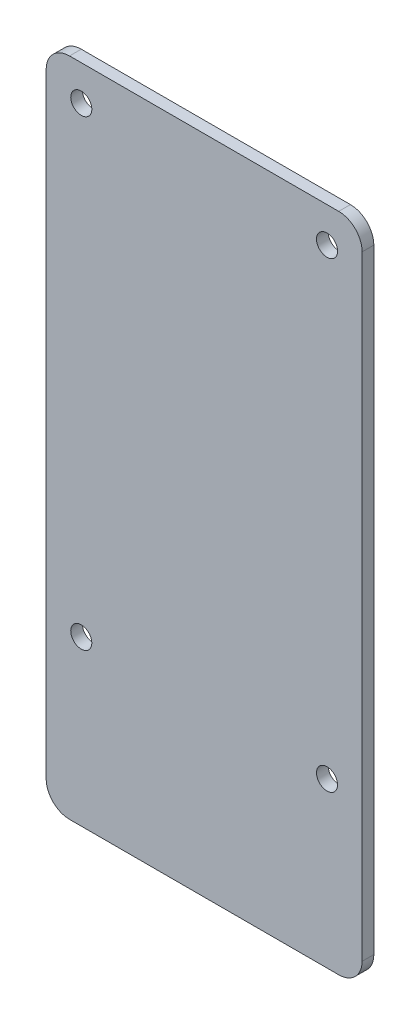
ISO-10303-21;
HEADER;
FILE_DESCRIPTION(('STEP AP214'),'2;1');
FILE_NAME('part.step','',(''),(''),'','','');
FILE_SCHEMA(('AUTOMOTIVE_DESIGN { 1 0 10303 214 1 1 1 1 }'));
ENDSEC;
DATA;
#1=APPLICATION_CONTEXT('core data for automotive mechanical design processes');
#2=APPLICATION_PROTOCOL_DEFINITION('international standard','automotive_design',2000,#1);
#3=PRODUCT_CONTEXT('',#1,'mechanical');
#4=PRODUCT('Part','Part','',(#3));
#5=PRODUCT_RELATED_PRODUCT_CATEGORY('part','',(#4));
#6=PRODUCT_DEFINITION_FORMATION('','',#4);
#7=PRODUCT_DEFINITION_CONTEXT('part definition',#1,'design');
#8=PRODUCT_DEFINITION('design','',#6,#7);
#9=PRODUCT_DEFINITION_SHAPE('','',#8);
#10=(LENGTH_UNIT() NAMED_UNIT(*) SI_UNIT(.MILLI.,.METRE.));
#11=(NAMED_UNIT(*) PLANE_ANGLE_UNIT() SI_UNIT($,.RADIAN.));
#12=(NAMED_UNIT(*) SI_UNIT($,.STERADIAN.) SOLID_ANGLE_UNIT());
#13=UNCERTAINTY_MEASURE_WITH_UNIT(LENGTH_MEASURE(1.E-05),#10,'distance_accuracy_value','');
#14=(GEOMETRIC_REPRESENTATION_CONTEXT(3) GLOBAL_UNCERTAINTY_ASSIGNED_CONTEXT((#13)) GLOBAL_UNIT_ASSIGNED_CONTEXT((#10,
#11,#12)) REPRESENTATION_CONTEXT('',''));
#15=CARTESIAN_POINT('',(0.,0.,0.));
#16=DIRECTION('',(0.,0.,1.));
#17=DIRECTION('',(1.,0.,0.));
#18=AXIS2_PLACEMENT_3D('',#15,#16,#17);
#19=CARTESIAN_POINT('',(-140.00000048,85.00000126,2.));
#20=DIRECTION('',(0.,0.,-1.));
#21=DIRECTION('',(-1.,0.,0.));
#22=AXIS2_PLACEMENT_3D('',#19,#20,#21);
#23=CYLINDRICAL_SURFACE('',#22,4.);
#24=CARTESIAN_POINT('',(-140.00000048,85.00000126,0.));
#25=DIRECTION('',(0.,0.,1.));
#26=DIRECTION('',(1.,0.,0.));
#27=AXIS2_PLACEMENT_3D('',#24,#25,#26);
#28=CIRCLE('',#27,4.);
#29=CARTESIAN_POINT('',(-140.00000048,89.00000126,0.));
#30=VERTEX_POINT('',#29);
#31=CARTESIAN_POINT('',(-144.00000048,85.00000126,0.));
#32=VERTEX_POINT('',#31);
#33=EDGE_CURVE('E130',#30,#32,#28,.T.);
#34=ORIENTED_EDGE('',*,*,#33,.T.);
#35=DIRECTION('',(0.,0.,-1.));
#36=VECTOR('',#35,1.);
#37=CARTESIAN_POINT('',(-144.00000048,85.00000126,2.));
#38=LINE('',#37,#36);
#39=CARTESIAN_POINT('',(-144.00000048,85.00000126,2.));
#40=VERTEX_POINT('',#39);
#41=EDGE_CURVE('E11',#40,#32,#38,.T.);
#42=ORIENTED_EDGE('',*,*,#41,.F.);
#43=CARTESIAN_POINT('',(-140.00000048,85.00000126,2.));
#44=DIRECTION('',(0.,0.,1.));
#45=DIRECTION('',(1.,0.,0.));
#46=AXIS2_PLACEMENT_3D('',#43,#44,#45);
#47=CIRCLE('',#46,4.);
#48=CARTESIAN_POINT('',(-140.00000048,89.00000126,2.));
#49=VERTEX_POINT('',#48);
#50=EDGE_CURVE('E144',#49,#40,#47,.T.);
#51=ORIENTED_EDGE('',*,*,#50,.F.);
#52=DIRECTION('',(0.,0.,-1.));
#53=VECTOR('',#52,1.);
#54=CARTESIAN_POINT('',(-140.00000048,89.00000126,2.));
#55=LINE('',#54,#53);
#56=EDGE_CURVE('E126',#49,#30,#55,.T.);
#57=ORIENTED_EDGE('',*,*,#56,.T.);
#58=EDGE_LOOP('',(#34,#42,#51,#57));
#59=FACE_BOUND('',#58,.T.);
#60=ADVANCED_FACE('F32',(#59),#23,.T.);
#61=CARTESIAN_POINT('',(-144.00000048,-19.99999918,2.));
#62=DIRECTION('',(1.,0.,0.));
#63=DIRECTION('',(0.,0.,-1.));
#64=AXIS2_PLACEMENT_3D('',#61,#62,#63);
#65=PLANE('',#64);
#66=DIRECTION('',(0.,-1.,0.));
#67=VECTOR('',#66,1.);
#68=CARTESIAN_POINT('',(-144.00000048,-19.99999918,0.));
#69=LINE('',#68,#67);
#70=CARTESIAN_POINT('',(-144.00000048,-19.99999918,0.));
#71=VERTEX_POINT('',#70);
#72=EDGE_CURVE('E133',#32,#71,#69,.T.);
#73=ORIENTED_EDGE('',*,*,#72,.T.);
#74=DIRECTION('',(0.,0.,-1.));
#75=VECTOR('',#74,1.);
#76=CARTESIAN_POINT('',(-144.00000048,-19.99999918,2.));
#77=LINE('',#76,#75);
#78=CARTESIAN_POINT('',(-144.00000048,-19.99999918,2.));
#79=VERTEX_POINT('',#78);
#80=EDGE_CURVE('E41',#79,#71,#77,.T.);
#81=ORIENTED_EDGE('',*,*,#80,.F.);
#82=DIRECTION('',(0.,-1.,0.));
#83=VECTOR('',#82,1.);
#84=CARTESIAN_POINT('',(-144.00000048,-19.99999918,2.));
#85=LINE('',#84,#83);
#86=EDGE_CURVE('E93',#40,#79,#85,.T.);
#87=ORIENTED_EDGE('',*,*,#86,.F.);
#88=ORIENTED_EDGE('',*,*,#41,.T.);
#89=EDGE_LOOP('',(#73,#81,#87,#88));
#90=FACE_BOUND('',#89,.T.);
#91=ADVANCED_FACE('F185',(#90),#65,.F.);
#92=CARTESIAN_POINT('',(-140.00000048,-19.99999918,2.));
#93=DIRECTION('',(0.,0.,-1.));
#94=DIRECTION('',(-1.,0.,0.));
#95=AXIS2_PLACEMENT_3D('',#92,#93,#94);
#96=CYLINDRICAL_SURFACE('',#95,4.);
#97=CARTESIAN_POINT('',(-140.00000048,-19.99999918,0.));
#98=DIRECTION('',(0.,0.,1.));
#99=DIRECTION('',(1.,0.,0.));
#100=AXIS2_PLACEMENT_3D('',#97,#98,#99);
#101=CIRCLE('',#100,4.);
#102=CARTESIAN_POINT('',(-140.00000048,-23.99999918,0.));
#103=VERTEX_POINT('',#102);
#104=EDGE_CURVE('E135',#71,#103,#101,.T.);
#105=ORIENTED_EDGE('',*,*,#104,.T.);
#106=DIRECTION('',(0.,0.,-1.));
#107=VECTOR('',#106,1.);
#108=CARTESIAN_POINT('',(-140.00000048,-23.99999918,2.));
#109=LINE('',#108,#107);
#110=CARTESIAN_POINT('',(-140.00000048,-23.99999918,2.));
#111=VERTEX_POINT('',#110);
#112=EDGE_CURVE('E151',#111,#103,#109,.T.);
#113=ORIENTED_EDGE('',*,*,#112,.F.);
#114=CARTESIAN_POINT('',(-140.00000048,-19.99999918,2.));
#115=DIRECTION('',(0.,0.,1.));
#116=DIRECTION('',(1.,0.,0.));
#117=AXIS2_PLACEMENT_3D('',#114,#115,#116);
#118=CIRCLE('',#117,4.);
#119=EDGE_CURVE('E200',#79,#111,#118,.T.);
#120=ORIENTED_EDGE('',*,*,#119,.F.);
#121=ORIENTED_EDGE('',*,*,#80,.T.);
#122=EDGE_LOOP('',(#105,#113,#120,#121));
#123=FACE_BOUND('',#122,.T.);
#124=ADVANCED_FACE('F190',(#123),#96,.T.);
#125=CARTESIAN_POINT('',(-93.99999888,-23.99999918,2.));
#126=DIRECTION('',(0.,1.,0.));
#127=DIRECTION('',(0.,0.,1.));
#128=AXIS2_PLACEMENT_3D('',#125,#126,#127);
#129=PLANE('',#128);
#130=DIRECTION('',(1.,0.,0.));
#131=VECTOR('',#130,1.);
#132=CARTESIAN_POINT('',(-93.99999888,-23.99999918,0.));
#133=LINE('',#132,#131);
#134=CARTESIAN_POINT('',(-93.99999888,-23.99999918,0.));
#135=VERTEX_POINT('',#134);
#136=EDGE_CURVE('E137',#103,#135,#133,.T.);
#137=ORIENTED_EDGE('',*,*,#136,.T.);
#138=DIRECTION('',(0.,0.,-1.));
#139=VECTOR('',#138,1.);
#140=CARTESIAN_POINT('',(-93.99999888,-23.99999918,2.));
#141=LINE('',#140,#139);
#142=CARTESIAN_POINT('',(-93.99999888,-23.99999918,2.));
#143=VERTEX_POINT('',#142);
#144=EDGE_CURVE('E148',#143,#135,#141,.T.);
#145=ORIENTED_EDGE('',*,*,#144,.F.);
#146=DIRECTION('',(1.,0.,0.));
#147=VECTOR('',#146,1.);
#148=CARTESIAN_POINT('',(-93.99999888,-23.99999918,2.));
#149=LINE('',#148,#147);
#150=EDGE_CURVE('E202',#111,#143,#149,.T.);
#151=ORIENTED_EDGE('',*,*,#150,.F.);
#152=ORIENTED_EDGE('',*,*,#112,.T.);
#153=EDGE_LOOP('',(#137,#145,#151,#152));
#154=FACE_BOUND('',#153,.T.);
#155=ADVANCED_FACE('F252',(#154),#129,.F.);
#156=CARTESIAN_POINT('',(-93.99999888,-19.99999918,2.));
#157=DIRECTION('',(0.,0.,-1.));
#158=DIRECTION('',(-1.,0.,0.));
#159=AXIS2_PLACEMENT_3D('',#156,#157,#158);
#160=CYLINDRICAL_SURFACE('',#159,4.);
#161=CARTESIAN_POINT('',(-93.99999888,-19.99999918,0.));
#162=DIRECTION('',(0.,0.,1.));
#163=DIRECTION('',(1.,0.,0.));
#164=AXIS2_PLACEMENT_3D('',#161,#162,#163);
#165=CIRCLE('',#164,4.);
#166=CARTESIAN_POINT('',(-89.99999888,-19.99999918,0.));
#167=VERTEX_POINT('',#166);
#168=EDGE_CURVE('E139',#135,#167,#165,.T.);
#169=ORIENTED_EDGE('',*,*,#168,.T.);
#170=DIRECTION('',(0.,0.,-1.));
#171=VECTOR('',#170,1.);
#172=CARTESIAN_POINT('',(-89.99999888,-19.99999918,2.));
#173=LINE('',#172,#171);
#174=CARTESIAN_POINT('',(-89.99999888,-19.99999918,2.));
#175=VERTEX_POINT('',#174);
#176=EDGE_CURVE('E121',#175,#167,#173,.T.);
#177=ORIENTED_EDGE('',*,*,#176,.F.);
#178=CARTESIAN_POINT('',(-93.99999888,-19.99999918,2.));
#179=DIRECTION('',(0.,0.,1.));
#180=DIRECTION('',(1.,0.,0.));
#181=AXIS2_PLACEMENT_3D('',#178,#179,#180);
#182=CIRCLE('',#181,4.);
#183=EDGE_CURVE('E112',#143,#175,#182,.T.);
#184=ORIENTED_EDGE('',*,*,#183,.F.);
#185=ORIENTED_EDGE('',*,*,#144,.T.);
#186=EDGE_LOOP('',(#169,#177,#184,#185));
#187=FACE_BOUND('',#186,.T.);
#188=ADVANCED_FACE('F249',(#187),#160,.T.);
#189=CARTESIAN_POINT('',(-89.99999888,85.00000126,2.));
#190=DIRECTION('',(-1.,0.,0.));
#191=DIRECTION('',(0.,0.,1.));
#192=AXIS2_PLACEMENT_3D('',#189,#190,#191);
#193=PLANE('',#192);
#194=DIRECTION('',(0.,1.,0.));
#195=VECTOR('',#194,1.);
#196=CARTESIAN_POINT('',(-89.99999888,85.00000126,0.));
#197=LINE('',#196,#195);
#198=CARTESIAN_POINT('',(-89.99999888,85.00000126,0.));
#199=VERTEX_POINT('',#198);
#200=EDGE_CURVE('E120',#167,#199,#197,.T.);
#201=ORIENTED_EDGE('',*,*,#200,.T.);
#202=DIRECTION('',(0.,0.,-1.));
#203=VECTOR('',#202,1.);
#204=CARTESIAN_POINT('',(-89.99999888,85.00000126,2.));
#205=LINE('',#204,#203);
#206=CARTESIAN_POINT('',(-89.99999888,85.00000126,2.));
#207=VERTEX_POINT('',#206);
#208=EDGE_CURVE('E117',#207,#199,#205,.T.);
#209=ORIENTED_EDGE('',*,*,#208,.F.);
#210=DIRECTION('',(0.,1.,0.));
#211=VECTOR('',#210,1.);
#212=CARTESIAN_POINT('',(-89.99999888,85.00000126,2.));
#213=LINE('',#212,#211);
#214=EDGE_CURVE('E106',#175,#207,#213,.T.);
#215=ORIENTED_EDGE('',*,*,#214,.F.);
#216=ORIENTED_EDGE('',*,*,#176,.T.);
#217=EDGE_LOOP('',(#201,#209,#215,#216));
#218=FACE_BOUND('',#217,.T.);
#219=ADVANCED_FACE('F118',(#218),#193,.F.);
#220=CARTESIAN_POINT('',(-93.99999888,85.00000126,2.));
#221=DIRECTION('',(0.,0.,-1.));
#222=DIRECTION('',(-1.,0.,0.));
#223=AXIS2_PLACEMENT_3D('',#220,#221,#222);
#224=CYLINDRICAL_SURFACE('',#223,4.);
#225=CARTESIAN_POINT('',(-93.99999888,85.00000126,0.));
#226=DIRECTION('',(0.,0.,1.));
#227=DIRECTION('',(1.,0.,0.));
#228=AXIS2_PLACEMENT_3D('',#225,#226,#227);
#229=CIRCLE('',#228,4.);
#230=CARTESIAN_POINT('',(-93.99999888,89.00000126,0.));
#231=VERTEX_POINT('',#230);
#232=EDGE_CURVE('E79',#199,#231,#229,.T.);
#233=ORIENTED_EDGE('',*,*,#232,.T.);
#234=DIRECTION('',(0.,0.,-1.));
#235=VECTOR('',#234,1.);
#236=CARTESIAN_POINT('',(-93.99999888,89.00000126,2.));
#237=LINE('',#236,#235);
#238=CARTESIAN_POINT('',(-93.99999888,89.00000126,2.));
#239=VERTEX_POINT('',#238);
#240=EDGE_CURVE('E122',#239,#231,#237,.T.);
#241=ORIENTED_EDGE('',*,*,#240,.F.);
#242=CARTESIAN_POINT('',(-93.99999888,85.00000126,2.));
#243=DIRECTION('',(0.,0.,1.));
#244=DIRECTION('',(1.,0.,0.));
#245=AXIS2_PLACEMENT_3D('',#242,#243,#244);
#246=CIRCLE('',#245,4.);
#247=EDGE_CURVE('E110',#207,#239,#246,.T.);
#248=ORIENTED_EDGE('',*,*,#247,.F.);
#249=ORIENTED_EDGE('',*,*,#208,.T.);
#250=EDGE_LOOP('',(#233,#241,#248,#249));
#251=FACE_BOUND('',#250,.T.);
#252=ADVANCED_FACE('F124',(#251),#224,.T.);
#253=CARTESIAN_POINT('',(-140.00000048,89.00000126,2.));
#254=DIRECTION('',(0.,-1.,0.));
#255=DIRECTION('',(0.,0.,-1.));
#256=AXIS2_PLACEMENT_3D('',#253,#254,#255);
#257=PLANE('',#256);
#258=DIRECTION('',(-1.,0.,0.));
#259=VECTOR('',#258,1.);
#260=CARTESIAN_POINT('',(-140.00000048,89.00000126,0.));
#261=LINE('',#260,#259);
#262=EDGE_CURVE('E85',#231,#30,#261,.T.);
#263=ORIENTED_EDGE('',*,*,#262,.T.);
#264=ORIENTED_EDGE('',*,*,#56,.F.);
#265=DIRECTION('',(-1.,0.,0.));
#266=VECTOR('',#265,1.);
#267=CARTESIAN_POINT('',(-140.00000048,89.00000126,2.));
#268=LINE('',#267,#266);
#269=EDGE_CURVE('E50',#239,#49,#268,.T.);
#270=ORIENTED_EDGE('',*,*,#269,.F.);
#271=ORIENTED_EDGE('',*,*,#240,.T.);
#272=EDGE_LOOP('',(#263,#264,#270,#271));
#273=FACE_BOUND('',#272,.T.);
#274=ADVANCED_FACE('F240',(#273),#257,.F.);
#275=CARTESIAN_POINT('',(-140.00000048,85.00000126,2.));
#276=DIRECTION('',(0.,0.,1.));
#277=DIRECTION('',(1.,0.,0.));
#278=AXIS2_PLACEMENT_3D('',#275,#276,#277);
#279=PLANE('',#278);
#280=CARTESIAN_POINT('',(-137.9999985,82.9999996200002,2.));
#281=DIRECTION('',(0.,0.,-1.));
#282=DIRECTION('',(-1.,0.,0.));
#283=AXIS2_PLACEMENT_3D('',#280,#281,#282);
#284=CIRCLE('',#283,1.79999999998381);
#285=CARTESIAN_POINT('',(-139.799998499984,82.9999996200002,2.));
#286=VERTEX_POINT('',#285);
#287=EDGE_CURVE('E210',#286,#286,#284,.T.);
#288=ORIENTED_EDGE('',*,*,#287,.T.);
#289=EDGE_LOOP('',(#288));
#290=FACE_BOUND('',#289,.T.);
#291=CARTESIAN_POINT('',(-95.9999985,3.99999962,2.));
#292=DIRECTION('',(0.,0.,-1.));
#293=DIRECTION('',(-1.,0.,0.));
#294=AXIS2_PLACEMENT_3D('',#291,#292,#293);
#295=CIRCLE('',#294,1.80000000001064);
#296=CARTESIAN_POINT('',(-97.7999985000106,3.99999962,2.));
#297=VERTEX_POINT('',#296);
#298=EDGE_CURVE('E211',#297,#297,#295,.T.);
#299=ORIENTED_EDGE('',*,*,#298,.T.);
#300=EDGE_LOOP('',(#299));
#301=FACE_BOUND('',#300,.T.);
#302=CARTESIAN_POINT('',(-137.9999985,3.99999962000014,2.));
#303=DIRECTION('',(0.,0.,-1.));
#304=DIRECTION('',(-1.,0.,0.));
#305=AXIS2_PLACEMENT_3D('',#302,#303,#304);
#306=CIRCLE('',#305,1.79999999998381);
#307=CARTESIAN_POINT('',(-139.799998499984,3.99999962000014,2.));
#308=VERTEX_POINT('',#307);
#309=EDGE_CURVE('E214',#308,#308,#306,.T.);
#310=ORIENTED_EDGE('',*,*,#309,.T.);
#311=EDGE_LOOP('',(#310));
#312=FACE_BOUND('',#311,.T.);
#313=CARTESIAN_POINT('',(-95.9999984999997,82.99999962,2.));
#314=DIRECTION('',(0.,0.,-1.));
#315=DIRECTION('',(-1.,0.,0.));
#316=AXIS2_PLACEMENT_3D('',#313,#314,#315);
#317=CIRCLE('',#316,1.80000000001064);
#318=CARTESIAN_POINT('',(-97.7999985000104,82.99999962,2.));
#319=VERTEX_POINT('',#318);
#320=EDGE_CURVE('E160',#319,#319,#317,.T.);
#321=ORIENTED_EDGE('',*,*,#320,.T.);
#322=EDGE_LOOP('',(#321));
#323=FACE_BOUND('',#322,.T.);
#324=ORIENTED_EDGE('',*,*,#50,.T.);
#325=ORIENTED_EDGE('',*,*,#86,.T.);
#326=ORIENTED_EDGE('',*,*,#119,.T.);
#327=ORIENTED_EDGE('',*,*,#150,.T.);
#328=ORIENTED_EDGE('',*,*,#183,.T.);
#329=ORIENTED_EDGE('',*,*,#214,.T.);
#330=ORIENTED_EDGE('',*,*,#247,.T.);
#331=ORIENTED_EDGE('',*,*,#269,.T.);
#332=EDGE_LOOP('',(#324,#325,#326,#327,#328,#329,#330,#331));
#333=FACE_BOUND('',#332,.T.);
#334=ADVANCED_FACE('F108',(#290,#301,#312,#323,#333),#279,.T.);
#335=CARTESIAN_POINT('',(-140.00000048,85.00000126,0.));
#336=DIRECTION('',(0.,0.,1.));
#337=DIRECTION('',(1.,0.,0.));
#338=AXIS2_PLACEMENT_3D('',#335,#336,#337);
#339=PLANE('',#338);
#340=CARTESIAN_POINT('',(-137.9999985,82.9999996200002,0.));
#341=DIRECTION('',(0.,0.,1.));
#342=DIRECTION('',(1.,0.,0.));
#343=AXIS2_PLACEMENT_3D('',#340,#341,#342);
#344=CIRCLE('',#343,1.79999999998381);
#345=CARTESIAN_POINT('',(-136.199998500016,82.9999996200002,0.));
#346=VERTEX_POINT('',#345);
#347=EDGE_CURVE('E35',#346,#346,#344,.T.);
#348=ORIENTED_EDGE('',*,*,#347,.T.);
#349=EDGE_LOOP('',(#348));
#350=FACE_BOUND('',#349,.T.);
#351=CARTESIAN_POINT('',(-95.9999985,3.99999962,0.));
#352=DIRECTION('',(0.,0.,1.));
#353=DIRECTION('',(1.,0.,0.));
#354=AXIS2_PLACEMENT_3D('',#351,#352,#353);
#355=CIRCLE('',#354,1.80000000001064);
#356=CARTESIAN_POINT('',(-94.1999984999894,3.99999962,0.));
#357=VERTEX_POINT('',#356);
#358=EDGE_CURVE('E162',#357,#357,#355,.T.);
#359=ORIENTED_EDGE('',*,*,#358,.T.);
#360=EDGE_LOOP('',(#359));
#361=FACE_BOUND('',#360,.T.);
#362=CARTESIAN_POINT('',(-137.9999985,3.99999962000014,0.));
#363=DIRECTION('',(0.,0.,1.));
#364=DIRECTION('',(1.,0.,0.));
#365=AXIS2_PLACEMENT_3D('',#362,#363,#364);
#366=CIRCLE('',#365,1.79999999998381);
#367=CARTESIAN_POINT('',(-136.199998500016,3.99999962000014,0.));
#368=VERTEX_POINT('',#367);
#369=EDGE_CURVE('E159',#368,#368,#366,.T.);
#370=ORIENTED_EDGE('',*,*,#369,.T.);
#371=EDGE_LOOP('',(#370));
#372=FACE_BOUND('',#371,.T.);
#373=CARTESIAN_POINT('',(-95.9999984999997,82.99999962,0.));
#374=DIRECTION('',(0.,0.,1.));
#375=DIRECTION('',(1.,0.,0.));
#376=AXIS2_PLACEMENT_3D('',#373,#374,#375);
#377=CIRCLE('',#376,1.80000000001064);
#378=CARTESIAN_POINT('',(-94.1999984999891,82.99999962,0.));
#379=VERTEX_POINT('',#378);
#380=EDGE_CURVE('E156',#379,#379,#377,.T.);
#381=ORIENTED_EDGE('',*,*,#380,.T.);
#382=EDGE_LOOP('',(#381));
#383=FACE_BOUND('',#382,.T.);
#384=ORIENTED_EDGE('',*,*,#33,.F.);
#385=ORIENTED_EDGE('',*,*,#262,.F.);
#386=ORIENTED_EDGE('',*,*,#232,.F.);
#387=ORIENTED_EDGE('',*,*,#200,.F.);
#388=ORIENTED_EDGE('',*,*,#168,.F.);
#389=ORIENTED_EDGE('',*,*,#136,.F.);
#390=ORIENTED_EDGE('',*,*,#104,.F.);
#391=ORIENTED_EDGE('',*,*,#72,.F.);
#392=EDGE_LOOP('',(#384,#385,#386,#387,#388,#389,#390,#391));
#393=FACE_BOUND('',#392,.T.);
#394=ADVANCED_FACE('F169',(#350,#361,#372,#383,#393),#339,.F.);
#395=CARTESIAN_POINT('',(-95.9999984999997,82.99999962,2.));
#396=DIRECTION('',(0.,0.,-1.));
#397=DIRECTION('',(-1.,0.,0.));
#398=AXIS2_PLACEMENT_3D('',#395,#396,#397);
#399=CYLINDRICAL_SURFACE('',#398,1.80000000001064);
#400=ORIENTED_EDGE('',*,*,#320,.F.);
#401=EDGE_LOOP('',(#400));
#402=FACE_BOUND('',#401,.T.);
#403=ORIENTED_EDGE('',*,*,#380,.F.);
#404=EDGE_LOOP('',(#403));
#405=FACE_BOUND('',#404,.T.);
#406=ADVANCED_FACE('F224',(#402,#405),#399,.F.);
#407=CARTESIAN_POINT('',(-137.9999985,3.99999962000014,2.));
#408=DIRECTION('',(0.,0.,-1.));
#409=DIRECTION('',(-1.,0.,0.));
#410=AXIS2_PLACEMENT_3D('',#407,#408,#409);
#411=CYLINDRICAL_SURFACE('',#410,1.79999999998381);
#412=ORIENTED_EDGE('',*,*,#309,.F.);
#413=EDGE_LOOP('',(#412));
#414=FACE_BOUND('',#413,.T.);
#415=ORIENTED_EDGE('',*,*,#369,.F.);
#416=EDGE_LOOP('',(#415));
#417=FACE_BOUND('',#416,.T.);
#418=ADVANCED_FACE('F179',(#414,#417),#411,.F.);
#419=CARTESIAN_POINT('',(-95.9999985,3.99999962,2.));
#420=DIRECTION('',(0.,0.,-1.));
#421=DIRECTION('',(-1.,0.,0.));
#422=AXIS2_PLACEMENT_3D('',#419,#420,#421);
#423=CYLINDRICAL_SURFACE('',#422,1.80000000001064);
#424=ORIENTED_EDGE('',*,*,#298,.F.);
#425=EDGE_LOOP('',(#424));
#426=FACE_BOUND('',#425,.T.);
#427=ORIENTED_EDGE('',*,*,#358,.F.);
#428=EDGE_LOOP('',(#427));
#429=FACE_BOUND('',#428,.T.);
#430=ADVANCED_FACE('F173',(#426,#429),#423,.F.);
#431=CARTESIAN_POINT('',(-137.9999985,82.9999996200002,2.));
#432=DIRECTION('',(0.,0.,-1.));
#433=DIRECTION('',(-1.,0.,0.));
#434=AXIS2_PLACEMENT_3D('',#431,#432,#433);
#435=CYLINDRICAL_SURFACE('',#434,1.79999999998381);
#436=ORIENTED_EDGE('',*,*,#287,.F.);
#437=EDGE_LOOP('',(#436));
#438=FACE_BOUND('',#437,.T.);
#439=ORIENTED_EDGE('',*,*,#347,.F.);
#440=EDGE_LOOP('',(#439));
#441=FACE_BOUND('',#440,.T.);
#442=ADVANCED_FACE('F171',(#438,#441),#435,.F.);
#443=CLOSED_SHELL('',(#60,#91,#124,#155,#188,#219,#252,#274,#334,#394,#406,#418,#430,#442));
#444=MANIFOLD_SOLID_BREP('B2',#443);
#445=ADVANCED_BREP_SHAPE_REPRESENTATION('',(#18,#444),#14);
#446=SHAPE_DEFINITION_REPRESENTATION(#9,#445);
ENDSEC;
END-ISO-10303-21;
